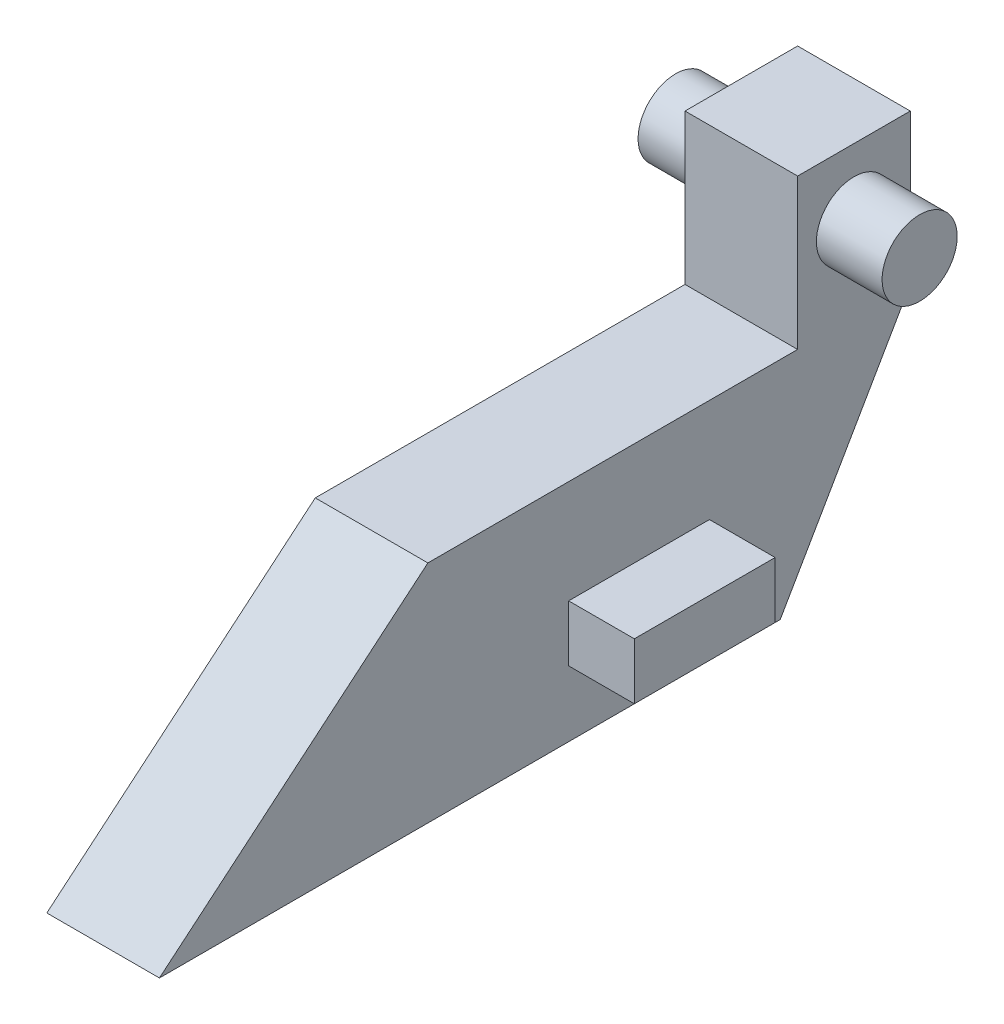
ISO-10303-21;
HEADER;
FILE_DESCRIPTION(('STEP AP214'),'2;1');
FILE_NAME('part.step','',(''),(''),'','','');
FILE_SCHEMA(('AUTOMOTIVE_DESIGN { 1 0 10303 214 1 1 1 1 }'));
ENDSEC;
DATA;
#1=APPLICATION_CONTEXT('core data for automotive mechanical design processes');
#2=APPLICATION_PROTOCOL_DEFINITION('international standard','automotive_design',2000,#1);
#3=PRODUCT_CONTEXT('',#1,'mechanical');
#4=PRODUCT('Part','Part','',(#3));
#5=PRODUCT_RELATED_PRODUCT_CATEGORY('part','',(#4));
#6=PRODUCT_DEFINITION_FORMATION('','',#4);
#7=PRODUCT_DEFINITION_CONTEXT('part definition',#1,'design');
#8=PRODUCT_DEFINITION('design','',#6,#7);
#9=PRODUCT_DEFINITION_SHAPE('','',#8);
#10=(LENGTH_UNIT() NAMED_UNIT(*) SI_UNIT(.MILLI.,.METRE.));
#11=(NAMED_UNIT(*) PLANE_ANGLE_UNIT() SI_UNIT($,.RADIAN.));
#12=(NAMED_UNIT(*) SI_UNIT($,.STERADIAN.) SOLID_ANGLE_UNIT());
#13=UNCERTAINTY_MEASURE_WITH_UNIT(LENGTH_MEASURE(1.E-05),#10,'distance_accuracy_value','');
#14=(GEOMETRIC_REPRESENTATION_CONTEXT(3) GLOBAL_UNCERTAINTY_ASSIGNED_CONTEXT((#13)) GLOBAL_UNIT_ASSIGNED_CONTEXT((#10,
#11,#12)) REPRESENTATION_CONTEXT('',''));
#15=CARTESIAN_POINT('',(0.,0.,0.));
#16=DIRECTION('',(0.,0.,1.));
#17=DIRECTION('',(1.,0.,0.));
#18=AXIS2_PLACEMENT_3D('',#15,#16,#17);
#19=CARTESIAN_POINT('',(6.,0.,-80.));
#20=DIRECTION('',(1.,0.,0.));
#21=DIRECTION('',(0.,1.,0.));
#22=AXIS2_PLACEMENT_3D('',#19,#20,#21);
#23=PLANE('',#22);
#24=DIRECTION('',(0.,0.,-1.));
#25=VECTOR('',#24,1.);
#26=CARTESIAN_POINT('',(6.,7.00000000000001,-43.6020862222614));
#27=LINE('',#26,#25);
#28=CARTESIAN_POINT('',(6.,7.00000000000001,-43.6020862222614));
#29=VERTEX_POINT('',#28);
#30=CARTESIAN_POINT('',(6.,7.,-58.6020862222614));
#31=VERTEX_POINT('',#30);
#32=EDGE_CURVE('E227',#29,#31,#27,.T.);
#33=ORIENTED_EDGE('',*,*,#32,.F.);
#34=DIRECTION('',(0.,-1.,0.));
#35=VECTOR('',#34,1.);
#36=CARTESIAN_POINT('',(5.99999999999999,13.,-43.6020862222614));
#37=LINE('',#36,#35);
#38=CARTESIAN_POINT('',(5.99999999999999,13.,-43.6020862222614));
#39=VERTEX_POINT('',#38);
#40=EDGE_CURVE('E213',#39,#29,#37,.T.);
#41=ORIENTED_EDGE('',*,*,#40,.F.);
#42=DIRECTION('',(0.,0.,1.));
#43=VECTOR('',#42,1.);
#44=CARTESIAN_POINT('',(5.99999999999999,13.,-43.6020862222614));
#45=LINE('',#44,#43);
#46=CARTESIAN_POINT('',(6.,13.,-58.6020862222614));
#47=VERTEX_POINT('',#46);
#48=EDGE_CURVE('E218',#47,#39,#45,.T.);
#49=ORIENTED_EDGE('',*,*,#48,.F.);
#50=DIRECTION('',(0.,1.,0.));
#51=VECTOR('',#50,1.);
#52=CARTESIAN_POINT('',(5.99999999999999,13.,-58.6020862222614));
#53=LINE('',#52,#51);
#54=EDGE_CURVE('E229',#31,#47,#53,.T.);
#55=ORIENTED_EDGE('',*,*,#54,.F.);
#56=EDGE_LOOP('',(#33,#41,#49,#55));
#57=FACE_BOUND('',#56,.T.);
#58=DIRECTION('',(0.,-0.866025403784436,0.500000000000004));
#59=VECTOR('',#58,1.);
#60=CARTESIAN_POINT('',(5.99999999999999,25.8714952434786,-81.0805082826095));
#61=LINE('',#60,#59);
#62=CARTESIAN_POINT('',(5.99999999999999,24.,-80.));
#63=VERTEX_POINT('',#62);
#64=CARTESIAN_POINT('',(6.,0.,-66.1435935394488));
#65=VERTEX_POINT('',#64);
#66=EDGE_CURVE('E242',#63,#65,#61,.T.);
#67=ORIENTED_EDGE('',*,*,#66,.F.);
#68=DIRECTION('',(0.,-1.,0.));
#69=VECTOR('',#68,1.);
#70=CARTESIAN_POINT('',(5.99999999999999,40.,-80.));
#71=LINE('',#70,#69);
#72=CARTESIAN_POINT('',(5.99999999999999,40.,-80.));
#73=VERTEX_POINT('',#72);
#74=EDGE_CURVE('E167',#73,#63,#71,.T.);
#75=ORIENTED_EDGE('',*,*,#74,.F.);
#76=DIRECTION('',(0.,0.,-1.));
#77=VECTOR('',#76,1.);
#78=CARTESIAN_POINT('',(5.99999999999999,40.,-80.));
#79=LINE('',#78,#77);
#80=CARTESIAN_POINT('',(5.99999999999999,40.,-68.));
#81=VERTEX_POINT('',#80);
#82=EDGE_CURVE('E151',#81,#73,#79,.T.);
#83=ORIENTED_EDGE('',*,*,#82,.F.);
#84=DIRECTION('',(0.,-1.,0.));
#85=VECTOR('',#84,1.);
#86=CARTESIAN_POINT('',(5.99999999999999,40.,-68.));
#87=LINE('',#86,#85);
#88=CARTESIAN_POINT('',(5.99999999999999,24.,-68.));
#89=VERTEX_POINT('',#88);
#90=EDGE_CURVE('E148',#81,#89,#87,.T.);
#91=ORIENTED_EDGE('',*,*,#90,.T.);
#92=DIRECTION('',(0.,0.,1.));
#93=VECTOR('',#92,1.);
#94=CARTESIAN_POINT('',(5.99999999999999,24.,-80.));
#95=LINE('',#94,#93);
#96=CARTESIAN_POINT('',(5.99999999999999,24.,-28.6020862222614));
#97=VERTEX_POINT('',#96);
#98=EDGE_CURVE('E43',#89,#97,#95,.T.);
#99=ORIENTED_EDGE('',*,*,#98,.T.);
#100=DIRECTION('',(0.,0.642787609686535,-0.766044443118982));
#101=VECTOR('',#100,1.);
#102=CARTESIAN_POINT('',(5.99999999999998,56.7130293057313,-67.5879564220067));
#103=LINE('',#102,#101);
#104=CARTESIAN_POINT('',(6.,0.,0.));
#105=VERTEX_POINT('',#104);
#106=EDGE_CURVE('E249',#105,#97,#103,.T.);
#107=ORIENTED_EDGE('',*,*,#106,.F.);
#108=DIRECTION('',(0.,0.,1.));
#109=VECTOR('',#108,1.);
#110=CARTESIAN_POINT('',(6.,0.,-80.));
#111=LINE('',#110,#109);
#112=EDGE_CURVE('E267',#65,#105,#111,.T.);
#113=ORIENTED_EDGE('',*,*,#112,.F.);
#114=EDGE_LOOP('',(#67,#75,#83,#91,#99,#107,#113));
#115=FACE_BOUND('',#114,.T.);
#116=CARTESIAN_POINT('',(5.99999999999999,32.9380397156745,-74.));
#117=DIRECTION('',(1.,0.,0.));
#118=DIRECTION('',(0.,1.,0.));
#119=AXIS2_PLACEMENT_3D('',#116,#117,#118);
#120=CIRCLE('',#119,4.00000000000001);
#121=CARTESIAN_POINT('',(5.99999999999999,36.9380397156745,-74.));
#122=VERTEX_POINT('',#121);
#123=EDGE_CURVE('E174',#122,#122,#120,.F.);
#124=ORIENTED_EDGE('',*,*,#123,.T.);
#125=EDGE_LOOP('',(#124));
#126=FACE_BOUND('',#125,.T.);
#127=ADVANCED_FACE('F34',(#57,#115,#126),#23,.T.);
#128=CARTESIAN_POINT('',(-6.,0.,-80.));
#129=DIRECTION('',(-1.,0.,0.));
#130=DIRECTION('',(0.,0.,1.));
#131=AXIS2_PLACEMENT_3D('',#128,#129,#130);
#132=PLANE('',#131);
#133=DIRECTION('',(0.,-0.866025403784436,0.500000000000004));
#134=VECTOR('',#133,1.);
#135=CARTESIAN_POINT('',(-6.,25.8714952434786,-81.0805082826095));
#136=LINE('',#135,#134);
#137=CARTESIAN_POINT('',(-6.,24.,-80.));
#138=VERTEX_POINT('',#137);
#139=CARTESIAN_POINT('',(-5.99999999999999,0.,-66.1435935394488));
#140=VERTEX_POINT('',#139);
#141=EDGE_CURVE('E243',#138,#140,#136,.T.);
#142=ORIENTED_EDGE('',*,*,#141,.T.);
#143=DIRECTION('',(0.,0.,1.));
#144=VECTOR('',#143,1.);
#145=CARTESIAN_POINT('',(-6.,0.,-80.));
#146=LINE('',#145,#144);
#147=CARTESIAN_POINT('',(-6.,0.,0.));
#148=VERTEX_POINT('',#147);
#149=EDGE_CURVE('E261',#140,#148,#146,.T.);
#150=ORIENTED_EDGE('',*,*,#149,.T.);
#151=DIRECTION('',(0.,0.642787609686535,-0.766044443118982));
#152=VECTOR('',#151,1.);
#153=CARTESIAN_POINT('',(-6.00000000000002,56.7130293057313,-67.5879564220067));
#154=LINE('',#153,#152);
#155=CARTESIAN_POINT('',(-6.,24.,-28.6020862222614));
#156=VERTEX_POINT('',#155);
#157=EDGE_CURVE('E250',#148,#156,#154,.T.);
#158=ORIENTED_EDGE('',*,*,#157,.T.);
#159=DIRECTION('',(0.,0.,1.));
#160=VECTOR('',#159,1.);
#161=CARTESIAN_POINT('',(-6.,24.,-80.));
#162=LINE('',#161,#160);
#163=CARTESIAN_POINT('',(-6.,24.,-68.));
#164=VERTEX_POINT('',#163);
#165=EDGE_CURVE('E11',#164,#156,#162,.T.);
#166=ORIENTED_EDGE('',*,*,#165,.F.);
#167=DIRECTION('',(0.,-1.,0.));
#168=VECTOR('',#167,1.);
#169=CARTESIAN_POINT('',(-6.,40.,-68.));
#170=LINE('',#169,#168);
#171=CARTESIAN_POINT('',(-6.,40.,-68.));
#172=VERTEX_POINT('',#171);
#173=EDGE_CURVE('E146',#172,#164,#170,.T.);
#174=ORIENTED_EDGE('',*,*,#173,.F.);
#175=DIRECTION('',(0.,0.,1.));
#176=VECTOR('',#175,1.);
#177=CARTESIAN_POINT('',(-6.,40.,-80.));
#178=LINE('',#177,#176);
#179=CARTESIAN_POINT('',(-6.,40.,-80.));
#180=VERTEX_POINT('',#179);
#181=EDGE_CURVE('E152',#180,#172,#178,.T.);
#182=ORIENTED_EDGE('',*,*,#181,.F.);
#183=DIRECTION('',(0.,-1.,0.));
#184=VECTOR('',#183,1.);
#185=CARTESIAN_POINT('',(-6.,40.,-80.));
#186=LINE('',#185,#184);
#187=EDGE_CURVE('E181',#180,#138,#186,.T.);
#188=ORIENTED_EDGE('',*,*,#187,.T.);
#189=EDGE_LOOP('',(#142,#150,#158,#166,#174,#182,#188));
#190=FACE_BOUND('',#189,.T.);
#191=DIRECTION('',(0.,-1.,0.));
#192=VECTOR('',#191,1.);
#193=CARTESIAN_POINT('',(-5.99999999999999,13.,-43.6020862222614));
#194=LINE('',#193,#192);
#195=CARTESIAN_POINT('',(-6.,13.,-43.6020862222614));
#196=VERTEX_POINT('',#195);
#197=CARTESIAN_POINT('',(-6.,7.00000000000001,-43.6020862222614));
#198=VERTEX_POINT('',#197);
#199=EDGE_CURVE('E164',#196,#198,#194,.T.);
#200=ORIENTED_EDGE('',*,*,#199,.T.);
#201=DIRECTION('',(0.,0.,-1.));
#202=VECTOR('',#201,1.);
#203=CARTESIAN_POINT('',(-6.,7.00000000000001,-43.6020862222614));
#204=LINE('',#203,#202);
#205=CARTESIAN_POINT('',(-6.,7.,-58.6020862222614));
#206=VERTEX_POINT('',#205);
#207=EDGE_CURVE('E189',#198,#206,#204,.T.);
#208=ORIENTED_EDGE('',*,*,#207,.T.);
#209=DIRECTION('',(0.,1.,0.));
#210=VECTOR('',#209,1.);
#211=CARTESIAN_POINT('',(-5.99999999999999,13.,-58.6020862222614));
#212=LINE('',#211,#210);
#213=CARTESIAN_POINT('',(-6.,13.,-58.6020862222614));
#214=VERTEX_POINT('',#213);
#215=EDGE_CURVE('E200',#206,#214,#212,.T.);
#216=ORIENTED_EDGE('',*,*,#215,.T.);
#217=DIRECTION('',(0.,0.,1.));
#218=VECTOR('',#217,1.);
#219=CARTESIAN_POINT('',(-5.99999999999999,13.,-43.6020862222614));
#220=LINE('',#219,#218);
#221=EDGE_CURVE('E58',#214,#196,#220,.T.);
#222=ORIENTED_EDGE('',*,*,#221,.T.);
#223=EDGE_LOOP('',(#200,#208,#216,#222));
#224=FACE_BOUND('',#223,.T.);
#225=CARTESIAN_POINT('',(-6.,32.9380397156745,-74.));
#226=DIRECTION('',(-1.,0.,0.));
#227=DIRECTION('',(0.,0.,1.));
#228=AXIS2_PLACEMENT_3D('',#225,#226,#227);
#229=CIRCLE('',#228,4.00000000000001);
#230=CARTESIAN_POINT('',(-6.,32.9380397156745,-70.));
#231=VERTEX_POINT('',#230);
#232=EDGE_CURVE('E38',#231,#231,#229,.F.);
#233=ORIENTED_EDGE('',*,*,#232,.T.);
#234=EDGE_LOOP('',(#233));
#235=FACE_BOUND('',#234,.T.);
#236=ADVANCED_FACE('F36',(#190,#224,#235),#132,.T.);
#237=CARTESIAN_POINT('',(-6.,24.,-80.));
#238=DIRECTION('',(0.,1.,0.));
#239=DIRECTION('',(-1.,0.,0.));
#240=AXIS2_PLACEMENT_3D('',#237,#238,#239);
#241=PLANE('',#240);
#242=DIRECTION('',(1.,0.,0.));
#243=VECTOR('',#242,1.);
#244=CARTESIAN_POINT('',(-6.,24.,-68.));
#245=LINE('',#244,#243);
#246=EDGE_CURVE('E50',#164,#89,#245,.T.);
#247=ORIENTED_EDGE('',*,*,#246,.F.);
#248=ORIENTED_EDGE('',*,*,#165,.T.);
#249=DIRECTION('',(1.,0.,0.));
#250=VECTOR('',#249,1.);
#251=CARTESIAN_POINT('',(-6.,24.,-28.6020862222614));
#252=LINE('',#251,#250);
#253=EDGE_CURVE('E252',#156,#97,#252,.T.);
#254=ORIENTED_EDGE('',*,*,#253,.T.);
#255=ORIENTED_EDGE('',*,*,#98,.F.);
#256=EDGE_LOOP('',(#247,#248,#254,#255));
#257=FACE_BOUND('',#256,.T.);
#258=ADVANCED_FACE('F282',(#257),#241,.T.);
#259=CARTESIAN_POINT('',(-6.,0.,-80.));
#260=DIRECTION('',(0.,-1.,0.));
#261=DIRECTION('',(1.,0.,0.));
#262=AXIS2_PLACEMENT_3D('',#259,#260,#261);
#263=PLANE('',#262);
#264=DIRECTION('',(1.,0.,0.));
#265=VECTOR('',#264,1.);
#266=CARTESIAN_POINT('',(-5.99999999999999,0.,-66.1435935394488));
#267=LINE('',#266,#265);
#268=EDGE_CURVE('E245',#140,#65,#267,.T.);
#269=ORIENTED_EDGE('',*,*,#268,.T.);
#270=ORIENTED_EDGE('',*,*,#112,.T.);
#271=DIRECTION('',(1.,0.,0.));
#272=VECTOR('',#271,1.);
#273=CARTESIAN_POINT('',(-6.,0.,0.));
#274=LINE('',#273,#272);
#275=EDGE_CURVE('E257',#148,#105,#274,.T.);
#276=ORIENTED_EDGE('',*,*,#275,.F.);
#277=ORIENTED_EDGE('',*,*,#149,.F.);
#278=EDGE_LOOP('',(#269,#270,#276,#277));
#279=FACE_BOUND('',#278,.T.);
#280=ADVANCED_FACE('F274',(#279),#263,.T.);
#281=CARTESIAN_POINT('',(-6.00000000000002,56.7130293057313,-67.5879564220067));
#282=DIRECTION('',(0.,-0.766044443118982,-0.642787609686535));
#283=DIRECTION('',(0.,0.642787609686535,-0.766044443118982));
#284=AXIS2_PLACEMENT_3D('',#281,#282,#283);
#285=PLANE('',#284);
#286=ORIENTED_EDGE('',*,*,#106,.T.);
#287=ORIENTED_EDGE('',*,*,#253,.F.);
#288=ORIENTED_EDGE('',*,*,#157,.F.);
#289=ORIENTED_EDGE('',*,*,#275,.T.);
#290=EDGE_LOOP('',(#286,#287,#288,#289));
#291=FACE_BOUND('',#290,.T.);
#292=ADVANCED_FACE('F279',(#291),#285,.F.);
#293=CARTESIAN_POINT('',(-6.,25.8714952434786,-81.0805082826095));
#294=DIRECTION('',(0.,0.500000000000004,0.866025403784436));
#295=DIRECTION('',(0.,-0.866025403784436,0.500000000000004));
#296=AXIS2_PLACEMENT_3D('',#293,#294,#295);
#297=PLANE('',#296);
#298=ORIENTED_EDGE('',*,*,#66,.T.);
#299=ORIENTED_EDGE('',*,*,#268,.F.);
#300=ORIENTED_EDGE('',*,*,#141,.F.);
#301=DIRECTION('',(-1.,0.,0.));
#302=VECTOR('',#301,1.);
#303=CARTESIAN_POINT('',(-6.,24.,-80.));
#304=LINE('',#303,#302);
#305=EDGE_CURVE('E258',#63,#138,#304,.T.);
#306=ORIENTED_EDGE('',*,*,#305,.F.);
#307=EDGE_LOOP('',(#298,#299,#300,#306));
#308=FACE_BOUND('',#307,.T.);
#309=ADVANCED_FACE('F331',(#308),#297,.F.);
#310=CARTESIAN_POINT('',(13.,13.,-43.6020862222614));
#311=DIRECTION('',(0.,0.,-1.));
#312=DIRECTION('',(-1.,0.,0.));
#313=AXIS2_PLACEMENT_3D('',#310,#311,#312);
#314=PLANE('',#313);
#315=ORIENTED_EDGE('',*,*,#40,.T.);
#316=DIRECTION('',(-1.,0.,0.));
#317=VECTOR('',#316,1.);
#318=CARTESIAN_POINT('',(13.,7.00000000000001,-43.6020862222614));
#319=LINE('',#318,#317);
#320=CARTESIAN_POINT('',(13.,7.00000000000001,-43.6020862222614));
#321=VERTEX_POINT('',#320);
#322=EDGE_CURVE('E240',#321,#29,#319,.T.);
#323=ORIENTED_EDGE('',*,*,#322,.F.);
#324=DIRECTION('',(0.,-1.,0.));
#325=VECTOR('',#324,1.);
#326=CARTESIAN_POINT('',(13.,13.,-43.6020862222614));
#327=LINE('',#326,#325);
#328=CARTESIAN_POINT('',(13.,13.,-43.6020862222614));
#329=VERTEX_POINT('',#328);
#330=EDGE_CURVE('E214',#329,#321,#327,.T.);
#331=ORIENTED_EDGE('',*,*,#330,.F.);
#332=DIRECTION('',(-1.,0.,0.));
#333=VECTOR('',#332,1.);
#334=CARTESIAN_POINT('',(13.,13.,-43.6020862222614));
#335=LINE('',#334,#333);
#336=EDGE_CURVE('E224',#329,#39,#335,.T.);
#337=ORIENTED_EDGE('',*,*,#336,.T.);
#338=EDGE_LOOP('',(#315,#323,#331,#337));
#339=FACE_BOUND('',#338,.T.);
#340=ADVANCED_FACE('F313',(#339),#314,.F.);
#341=CARTESIAN_POINT('',(13.,7.00000000000001,-43.6020862222614));
#342=DIRECTION('',(0.,1.,0.));
#343=DIRECTION('',(-1.,0.,0.));
#344=AXIS2_PLACEMENT_3D('',#341,#342,#343);
#345=PLANE('',#344);
#346=ORIENTED_EDGE('',*,*,#32,.T.);
#347=DIRECTION('',(-1.,0.,0.));
#348=VECTOR('',#347,1.);
#349=CARTESIAN_POINT('',(13.,7.00000000000001,-58.6020862222614));
#350=LINE('',#349,#348);
#351=CARTESIAN_POINT('',(13.,7.00000000000001,-58.6020862222614));
#352=VERTEX_POINT('',#351);
#353=EDGE_CURVE('E237',#352,#31,#350,.T.);
#354=ORIENTED_EDGE('',*,*,#353,.F.);
#355=DIRECTION('',(0.,0.,-1.));
#356=VECTOR('',#355,1.);
#357=CARTESIAN_POINT('',(13.,7.00000000000001,-43.6020862222614));
#358=LINE('',#357,#356);
#359=EDGE_CURVE('E217',#321,#352,#358,.T.);
#360=ORIENTED_EDGE('',*,*,#359,.F.);
#361=ORIENTED_EDGE('',*,*,#322,.T.);
#362=EDGE_LOOP('',(#346,#354,#360,#361));
#363=FACE_BOUND('',#362,.T.);
#364=ADVANCED_FACE('F301',(#363),#345,.F.);
#365=CARTESIAN_POINT('',(13.,13.,-58.6020862222614));
#366=DIRECTION('',(0.,0.,1.));
#367=DIRECTION('',(0.,-1.,0.));
#368=AXIS2_PLACEMENT_3D('',#365,#366,#367);
#369=PLANE('',#368);
#370=ORIENTED_EDGE('',*,*,#54,.T.);
#371=DIRECTION('',(-1.,0.,0.));
#372=VECTOR('',#371,1.);
#373=CARTESIAN_POINT('',(13.,13.,-58.6020862222614));
#374=LINE('',#373,#372);
#375=CARTESIAN_POINT('',(13.,13.,-58.6020862222614));
#376=VERTEX_POINT('',#375);
#377=EDGE_CURVE('E235',#376,#47,#374,.T.);
#378=ORIENTED_EDGE('',*,*,#377,.F.);
#379=DIRECTION('',(0.,1.,0.));
#380=VECTOR('',#379,1.);
#381=CARTESIAN_POINT('',(13.,13.,-58.6020862222614));
#382=LINE('',#381,#380);
#383=EDGE_CURVE('E220',#352,#376,#382,.T.);
#384=ORIENTED_EDGE('',*,*,#383,.F.);
#385=ORIENTED_EDGE('',*,*,#353,.T.);
#386=EDGE_LOOP('',(#370,#378,#384,#385));
#387=FACE_BOUND('',#386,.T.);
#388=ADVANCED_FACE('F305',(#387),#369,.F.);
#389=CARTESIAN_POINT('',(13.,13.,-43.6020862222614));
#390=DIRECTION('',(0.,-1.,0.));
#391=DIRECTION('',(1.,0.,0.));
#392=AXIS2_PLACEMENT_3D('',#389,#390,#391);
#393=PLANE('',#392);
#394=ORIENTED_EDGE('',*,*,#48,.T.);
#395=ORIENTED_EDGE('',*,*,#336,.F.);
#396=DIRECTION('',(0.,0.,1.));
#397=VECTOR('',#396,1.);
#398=CARTESIAN_POINT('',(13.,13.,-43.6020862222614));
#399=LINE('',#398,#397);
#400=EDGE_CURVE('E222',#376,#329,#399,.T.);
#401=ORIENTED_EDGE('',*,*,#400,.F.);
#402=ORIENTED_EDGE('',*,*,#377,.T.);
#403=EDGE_LOOP('',(#394,#395,#401,#402));
#404=FACE_BOUND('',#403,.T.);
#405=ADVANCED_FACE('F315',(#404),#393,.F.);
#406=CARTESIAN_POINT('',(13.,7.00000000000001,-43.6020862222614));
#407=DIRECTION('',(1.,0.,0.));
#408=DIRECTION('',(0.,1.,0.));
#409=AXIS2_PLACEMENT_3D('',#406,#407,#408);
#410=PLANE('',#409);
#411=ORIENTED_EDGE('',*,*,#330,.T.);
#412=ORIENTED_EDGE('',*,*,#359,.T.);
#413=ORIENTED_EDGE('',*,*,#383,.T.);
#414=ORIENTED_EDGE('',*,*,#400,.T.);
#415=EDGE_LOOP('',(#411,#412,#413,#414));
#416=FACE_BOUND('',#415,.T.);
#417=ADVANCED_FACE('F309',(#416),#410,.T.);
#418=CARTESIAN_POINT('',(-13.,13.,-43.6020862222614));
#419=DIRECTION('',(0.,0.,1.));
#420=DIRECTION('',(1.,0.,0.));
#421=AXIS2_PLACEMENT_3D('',#418,#419,#420);
#422=PLANE('',#421);
#423=ORIENTED_EDGE('',*,*,#199,.F.);
#424=DIRECTION('',(1.,0.,0.));
#425=VECTOR('',#424,1.);
#426=CARTESIAN_POINT('',(-13.,13.,-43.6020862222614));
#427=LINE('',#426,#425);
#428=CARTESIAN_POINT('',(-13.,13.,-43.6020862222614));
#429=VERTEX_POINT('',#428);
#430=EDGE_CURVE('E211',#429,#196,#427,.T.);
#431=ORIENTED_EDGE('',*,*,#430,.F.);
#432=DIRECTION('',(0.,-1.,0.));
#433=VECTOR('',#432,1.);
#434=CARTESIAN_POINT('',(-13.,13.,-43.6020862222614));
#435=LINE('',#434,#433);
#436=CARTESIAN_POINT('',(-13.,7.00000000000001,-43.6020862222614));
#437=VERTEX_POINT('',#436);
#438=EDGE_CURVE('E185',#429,#437,#435,.T.);
#439=ORIENTED_EDGE('',*,*,#438,.T.);
#440=DIRECTION('',(1.,0.,0.));
#441=VECTOR('',#440,1.);
#442=CARTESIAN_POINT('',(-13.,7.00000000000001,-43.6020862222614));
#443=LINE('',#442,#441);
#444=EDGE_CURVE('E197',#437,#198,#443,.T.);
#445=ORIENTED_EDGE('',*,*,#444,.T.);
#446=EDGE_LOOP('',(#423,#431,#439,#445));
#447=FACE_BOUND('',#446,.T.);
#448=ADVANCED_FACE('F322',(#447),#422,.T.);
#449=CARTESIAN_POINT('',(-13.,13.,-43.6020862222614));
#450=DIRECTION('',(0.,1.,0.));
#451=DIRECTION('',(-1.,0.,0.));
#452=AXIS2_PLACEMENT_3D('',#449,#450,#451);
#453=PLANE('',#452);
#454=ORIENTED_EDGE('',*,*,#221,.F.);
#455=DIRECTION('',(1.,0.,0.));
#456=VECTOR('',#455,1.);
#457=CARTESIAN_POINT('',(-13.,13.,-58.6020862222614));
#458=LINE('',#457,#456);
#459=CARTESIAN_POINT('',(-13.,13.,-58.6020862222614));
#460=VERTEX_POINT('',#459);
#461=EDGE_CURVE('E208',#460,#214,#458,.T.);
#462=ORIENTED_EDGE('',*,*,#461,.F.);
#463=DIRECTION('',(0.,0.,1.));
#464=VECTOR('',#463,1.);
#465=CARTESIAN_POINT('',(-13.,13.,-43.6020862222614));
#466=LINE('',#465,#464);
#467=EDGE_CURVE('E188',#460,#429,#466,.T.);
#468=ORIENTED_EDGE('',*,*,#467,.T.);
#469=ORIENTED_EDGE('',*,*,#430,.T.);
#470=EDGE_LOOP('',(#454,#462,#468,#469));
#471=FACE_BOUND('',#470,.T.);
#472=ADVANCED_FACE('F375',(#471),#453,.T.);
#473=CARTESIAN_POINT('',(-13.,13.,-58.6020862222614));
#474=DIRECTION('',(0.,0.,-1.));
#475=DIRECTION('',(0.,1.,0.));
#476=AXIS2_PLACEMENT_3D('',#473,#474,#475);
#477=PLANE('',#476);
#478=ORIENTED_EDGE('',*,*,#215,.F.);
#479=DIRECTION('',(1.,0.,0.));
#480=VECTOR('',#479,1.);
#481=CARTESIAN_POINT('',(-13.,7.00000000000001,-58.6020862222614));
#482=LINE('',#481,#480);
#483=CARTESIAN_POINT('',(-13.,7.00000000000001,-58.6020862222614));
#484=VERTEX_POINT('',#483);
#485=EDGE_CURVE('E205',#484,#206,#482,.T.);
#486=ORIENTED_EDGE('',*,*,#485,.F.);
#487=DIRECTION('',(0.,1.,0.));
#488=VECTOR('',#487,1.);
#489=CARTESIAN_POINT('',(-13.,13.,-58.6020862222614));
#490=LINE('',#489,#488);
#491=EDGE_CURVE('E192',#484,#460,#490,.T.);
#492=ORIENTED_EDGE('',*,*,#491,.T.);
#493=ORIENTED_EDGE('',*,*,#461,.T.);
#494=EDGE_LOOP('',(#478,#486,#492,#493));
#495=FACE_BOUND('',#494,.T.);
#496=ADVANCED_FACE('F384',(#495),#477,.T.);
#497=CARTESIAN_POINT('',(-13.,7.00000000000001,-43.6020862222614));
#498=DIRECTION('',(0.,-1.,0.));
#499=DIRECTION('',(1.,0.,0.));
#500=AXIS2_PLACEMENT_3D('',#497,#498,#499);
#501=PLANE('',#500);
#502=ORIENTED_EDGE('',*,*,#207,.F.);
#503=ORIENTED_EDGE('',*,*,#444,.F.);
#504=DIRECTION('',(0.,0.,-1.));
#505=VECTOR('',#504,1.);
#506=CARTESIAN_POINT('',(-13.,7.00000000000001,-43.6020862222614));
#507=LINE('',#506,#505);
#508=EDGE_CURVE('E195',#437,#484,#507,.T.);
#509=ORIENTED_EDGE('',*,*,#508,.T.);
#510=ORIENTED_EDGE('',*,*,#485,.T.);
#511=EDGE_LOOP('',(#502,#503,#509,#510));
#512=FACE_BOUND('',#511,.T.);
#513=ADVANCED_FACE('F394',(#512),#501,.T.);
#514=CARTESIAN_POINT('',(-13.,7.00000000000001,-43.6020862222614));
#515=DIRECTION('',(-1.,0.,0.));
#516=DIRECTION('',(0.,1.,0.));
#517=AXIS2_PLACEMENT_3D('',#514,#515,#516);
#518=PLANE('',#517);
#519=ORIENTED_EDGE('',*,*,#438,.F.);
#520=ORIENTED_EDGE('',*,*,#467,.F.);
#521=ORIENTED_EDGE('',*,*,#491,.F.);
#522=ORIENTED_EDGE('',*,*,#508,.F.);
#523=EDGE_LOOP('',(#519,#520,#521,#522));
#524=FACE_BOUND('',#523,.T.);
#525=ADVANCED_FACE('F404',(#524),#518,.T.);
#526=CARTESIAN_POINT('',(-6.,40.,-68.));
#527=DIRECTION('',(0.,0.,-1.));
#528=DIRECTION('',(-1.,0.,0.));
#529=AXIS2_PLACEMENT_3D('',#526,#527,#528);
#530=PLANE('',#529);
#531=ORIENTED_EDGE('',*,*,#246,.T.);
#532=ORIENTED_EDGE('',*,*,#90,.F.);
#533=DIRECTION('',(1.,0.,0.));
#534=VECTOR('',#533,1.);
#535=CARTESIAN_POINT('',(-6.,40.,-68.));
#536=LINE('',#535,#534);
#537=EDGE_CURVE('E142',#172,#81,#536,.T.);
#538=ORIENTED_EDGE('',*,*,#537,.F.);
#539=ORIENTED_EDGE('',*,*,#173,.T.);
#540=EDGE_LOOP('',(#531,#532,#538,#539));
#541=FACE_BOUND('',#540,.T.);
#542=ADVANCED_FACE('F144',(#541),#530,.F.);
#543=CARTESIAN_POINT('',(-6.,40.,-80.));
#544=DIRECTION('',(0.,0.,1.));
#545=DIRECTION('',(1.,0.,0.));
#546=AXIS2_PLACEMENT_3D('',#543,#544,#545);
#547=PLANE('',#546);
#548=ORIENTED_EDGE('',*,*,#305,.T.);
#549=ORIENTED_EDGE('',*,*,#187,.F.);
#550=DIRECTION('',(-1.,0.,0.));
#551=VECTOR('',#550,1.);
#552=CARTESIAN_POINT('',(-6.,40.,-80.));
#553=LINE('',#552,#551);
#554=EDGE_CURVE('E157',#73,#180,#553,.T.);
#555=ORIENTED_EDGE('',*,*,#554,.F.);
#556=ORIENTED_EDGE('',*,*,#74,.T.);
#557=EDGE_LOOP('',(#548,#549,#555,#556));
#558=FACE_BOUND('',#557,.T.);
#559=ADVANCED_FACE('F438',(#558),#547,.F.);
#560=CARTESIAN_POINT('',(-6.,40.,-68.));
#561=DIRECTION('',(0.,1.,0.));
#562=DIRECTION('',(0.,0.,1.));
#563=AXIS2_PLACEMENT_3D('',#560,#561,#562);
#564=PLANE('',#563);
#565=ORIENTED_EDGE('',*,*,#181,.T.);
#566=ORIENTED_EDGE('',*,*,#537,.T.);
#567=ORIENTED_EDGE('',*,*,#82,.T.);
#568=ORIENTED_EDGE('',*,*,#554,.T.);
#569=EDGE_LOOP('',(#565,#566,#567,#568));
#570=FACE_BOUND('',#569,.T.);
#571=ADVANCED_FACE('F155',(#570),#564,.T.);
#572=CARTESIAN_POINT('',(-13.,32.9380397156745,-74.));
#573=DIRECTION('',(1.,0.,0.));
#574=DIRECTION('',(0.,0.,-1.));
#575=AXIS2_PLACEMENT_3D('',#572,#573,#574);
#576=PLANE('',#575);
#577=CARTESIAN_POINT('',(-13.,32.9380397156745,-74.));
#578=DIRECTION('',(1.,0.,0.));
#579=DIRECTION('',(0.,0.,-1.));
#580=AXIS2_PLACEMENT_3D('',#577,#578,#579);
#581=CIRCLE('',#580,4.00000000000001);
#582=CARTESIAN_POINT('',(-13.,32.9380397156745,-78.));
#583=VERTEX_POINT('',#582);
#584=EDGE_CURVE('E518',#583,#583,#581,.T.);
#585=ORIENTED_EDGE('',*,*,#584,.F.);
#586=EDGE_LOOP('',(#585));
#587=FACE_BOUND('',#586,.T.);
#588=ADVANCED_FACE('F451',(#587),#576,.F.);
#589=CARTESIAN_POINT('',(13.,32.9380397156745,-74.));
#590=DIRECTION('',(-1.,0.,0.));
#591=DIRECTION('',(0.,0.,1.));
#592=AXIS2_PLACEMENT_3D('',#589,#590,#591);
#593=CYLINDRICAL_SURFACE('',#592,4.00000000000001);
#594=ORIENTED_EDGE('',*,*,#232,.F.);
#595=EDGE_LOOP('',(#594));
#596=FACE_BOUND('',#595,.T.);
#597=ORIENTED_EDGE('',*,*,#584,.T.);
#598=EDGE_LOOP('',(#597));
#599=FACE_BOUND('',#598,.T.);
#600=ADVANCED_FACE('F458',(#596,#599),#593,.T.);
#601=ORIENTED_EDGE('',*,*,#123,.F.);
#602=EDGE_LOOP('',(#601));
#603=FACE_BOUND('',#602,.T.);
#604=CARTESIAN_POINT('',(13.,32.9380397156745,-74.));
#605=DIRECTION('',(1.,0.,0.));
#606=DIRECTION('',(0.,0.,-1.));
#607=AXIS2_PLACEMENT_3D('',#604,#605,#606);
#608=CIRCLE('',#607,4.00000000000001);
#609=CARTESIAN_POINT('',(13.,32.9380397156745,-78.));
#610=VERTEX_POINT('',#609);
#611=EDGE_CURVE('E516',#610,#610,#608,.T.);
#612=ORIENTED_EDGE('',*,*,#611,.F.);
#613=EDGE_LOOP('',(#612));
#614=FACE_BOUND('',#613,.T.);
#615=ADVANCED_FACE('F467',(#603,#614),#593,.T.);
#616=CARTESIAN_POINT('',(13.,32.9380397156745,-74.));
#617=DIRECTION('',(1.,0.,0.));
#618=DIRECTION('',(0.,0.,-1.));
#619=AXIS2_PLACEMENT_3D('',#616,#617,#618);
#620=PLANE('',#619);
#621=ORIENTED_EDGE('',*,*,#611,.T.);
#622=EDGE_LOOP('',(#621));
#623=FACE_BOUND('',#622,.T.);
#624=ADVANCED_FACE('F475',(#623),#620,.T.);
#625=CLOSED_SHELL('',(#127,#236,#258,#280,#292,#309,#340,#364,#388,#405,#417,#448,#472,#496,
#513,#525,#542,#559,#571,#588,#600,#615,#624));
#626=MANIFOLD_SOLID_BREP('B2',#625);
#627=ADVANCED_BREP_SHAPE_REPRESENTATION('',(#18,#626),#14);
#628=SHAPE_DEFINITION_REPRESENTATION(#9,#627);
ENDSEC;
END-ISO-10303-21;
